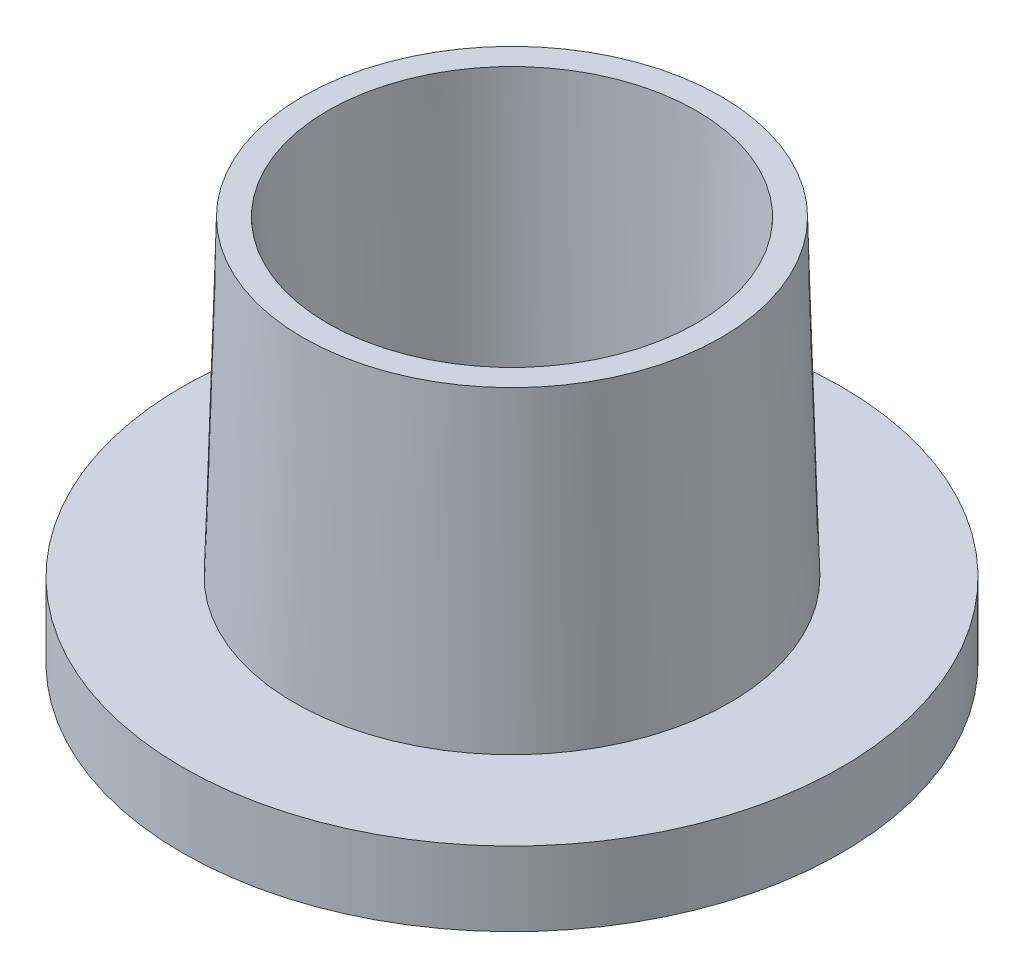
ISO-10303-21;
HEADER;
FILE_DESCRIPTION(('STEP AP214'),'2;1');
FILE_NAME('part.step','',(''),(''),'','','');
FILE_SCHEMA(('AUTOMOTIVE_DESIGN { 1 0 10303 214 1 1 1 1 }'));
ENDSEC;
DATA;
#1=APPLICATION_CONTEXT('core data for automotive mechanical design processes');
#2=APPLICATION_PROTOCOL_DEFINITION('international standard','automotive_design',2000,#1);
#3=PRODUCT_CONTEXT('',#1,'mechanical');
#4=PRODUCT('Part','Part','',(#3));
#5=PRODUCT_RELATED_PRODUCT_CATEGORY('part','',(#4));
#6=PRODUCT_DEFINITION_FORMATION('','',#4);
#7=PRODUCT_DEFINITION_CONTEXT('part definition',#1,'design');
#8=PRODUCT_DEFINITION('design','',#6,#7);
#9=PRODUCT_DEFINITION_SHAPE('','',#8);
#10=(LENGTH_UNIT() NAMED_UNIT(*) SI_UNIT(.MILLI.,.METRE.));
#11=(NAMED_UNIT(*) PLANE_ANGLE_UNIT() SI_UNIT($,.RADIAN.));
#12=(NAMED_UNIT(*) SI_UNIT($,.STERADIAN.) SOLID_ANGLE_UNIT());
#13=UNCERTAINTY_MEASURE_WITH_UNIT(LENGTH_MEASURE(1.E-05),#10,'distance_accuracy_value','');
#14=(GEOMETRIC_REPRESENTATION_CONTEXT(3) GLOBAL_UNCERTAINTY_ASSIGNED_CONTEXT((#13)) GLOBAL_UNIT_ASSIGNED_CONTEXT((#10,
#11,#12)) REPRESENTATION_CONTEXT('',''));
#15=CARTESIAN_POINT('',(0.,0.,0.));
#16=DIRECTION('',(0.,0.,1.));
#17=DIRECTION('',(1.,0.,0.));
#18=AXIS2_PLACEMENT_3D('',#15,#16,#17);
#19=CARTESIAN_POINT('',(-20.,0.,0.));
#20=DIRECTION('',(0.,1.,0.));
#21=DIRECTION('',(0.,0.,1.));
#22=AXIS2_PLACEMENT_3D('',#19,#20,#21);
#23=PLANE('',#22);
#24=CARTESIAN_POINT('',(0.,0.,0.));
#25=DIRECTION('',(0.,-1.,0.));
#26=DIRECTION('',(0.,0.,-1.));
#27=AXIS2_PLACEMENT_3D('',#24,#25,#26);
#28=CIRCLE('',#27,10.6);
#29=CARTESIAN_POINT('',(0.,0.,-10.6));
#30=VERTEX_POINT('',#29);
#31=EDGE_CURVE('E64',#30,#30,#28,.T.);
#32=ORIENTED_EDGE('',*,*,#31,.F.);
#33=EDGE_LOOP('',(#32));
#34=FACE_BOUND('',#33,.T.);
#35=CARTESIAN_POINT('',(0.,0.,0.));
#36=DIRECTION('',(0.,-1.,0.));
#37=DIRECTION('',(0.,0.,-1.));
#38=AXIS2_PLACEMENT_3D('',#35,#36,#37);
#39=CIRCLE('',#38,20.);
#40=CARTESIAN_POINT('',(0.,0.,-20.));
#41=VERTEX_POINT('',#40);
#42=EDGE_CURVE('E10',#41,#41,#39,.T.);
#43=ORIENTED_EDGE('',*,*,#42,.T.);
#44=EDGE_LOOP('',(#43));
#45=FACE_BOUND('',#44,.T.);
#46=ADVANCED_FACE('F37',(#34,#45),#23,.F.);
#47=CARTESIAN_POINT('',(0.,0.,0.));
#48=DIRECTION('',(0.,-1.,0.));
#49=DIRECTION('',(0.,0.,-1.));
#50=AXIS2_PLACEMENT_3D('',#47,#48,#49);
#51=CYLINDRICAL_SURFACE('',#50,20.);
#52=ORIENTED_EDGE('',*,*,#42,.F.);
#53=EDGE_LOOP('',(#52));
#54=FACE_BOUND('',#53,.T.);
#55=CARTESIAN_POINT('',(0.,4.5,0.));
#56=DIRECTION('',(0.,-1.,0.));
#57=DIRECTION('',(0.,0.,-1.));
#58=AXIS2_PLACEMENT_3D('',#55,#56,#57);
#59=CIRCLE('',#58,20.);
#60=CARTESIAN_POINT('',(0.,4.5,-20.));
#61=VERTEX_POINT('',#60);
#62=EDGE_CURVE('E44',#61,#61,#59,.T.);
#63=ORIENTED_EDGE('',*,*,#62,.T.);
#64=EDGE_LOOP('',(#63));
#65=FACE_BOUND('',#64,.T.);
#66=ADVANCED_FACE('F72',(#54,#65),#51,.T.);
#67=CARTESIAN_POINT('',(-13.2127158461161,4.5,0.));
#68=DIRECTION('',(0.,-1.,0.));
#69=DIRECTION('',(0.,0.,-1.));
#70=AXIS2_PLACEMENT_3D('',#67,#68,#69);
#71=PLANE('',#70);
#72=ORIENTED_EDGE('',*,*,#62,.F.);
#73=EDGE_LOOP('',(#72));
#74=FACE_BOUND('',#73,.T.);
#75=CARTESIAN_POINT('',(0.,4.5,0.));
#76=DIRECTION('',(0.,-1.,0.));
#77=DIRECTION('',(0.,0.,-1.));
#78=AXIS2_PLACEMENT_3D('',#75,#76,#77);
#79=CIRCLE('',#78,13.2127158461161);
#80=CARTESIAN_POINT('',(0.,4.5,-13.2127158461161));
#81=VERTEX_POINT('',#80);
#82=EDGE_CURVE('E49',#81,#81,#79,.T.);
#83=ORIENTED_EDGE('',*,*,#82,.T.);
#84=EDGE_LOOP('',(#83));
#85=FACE_BOUND('',#84,.T.);
#86=ADVANCED_FACE('F76',(#74,#85),#71,.F.);
#87=CARTESIAN_POINT('',(0.,23.42,0.));
#88=DIRECTION('',(0.,-1.,0.));
#89=DIRECTION('',(0.,0.,-1.));
#90=AXIS2_PLACEMENT_3D('',#87,#88,#89);
#91=CONICAL_SURFACE('',#90,12.685,0.0278847284594017);
#92=ORIENTED_EDGE('',*,*,#82,.F.);
#93=EDGE_LOOP('',(#92));
#94=FACE_BOUND('',#93,.T.);
#95=CARTESIAN_POINT('',(0.,23.42,0.));
#96=DIRECTION('',(0.,-1.,0.));
#97=DIRECTION('',(0.,0.,-1.));
#98=AXIS2_PLACEMENT_3D('',#95,#96,#97);
#99=CIRCLE('',#98,12.685);
#100=CARTESIAN_POINT('',(0.,23.42,-12.685));
#101=VERTEX_POINT('',#100);
#102=EDGE_CURVE('E54',#101,#101,#99,.T.);
#103=ORIENTED_EDGE('',*,*,#102,.T.);
#104=EDGE_LOOP('',(#103));
#105=FACE_BOUND('',#104,.T.);
#106=ADVANCED_FACE('F81',(#94,#105),#91,.T.);
#107=CARTESIAN_POINT('',(-11.185,23.42,0.));
#108=DIRECTION('',(0.,-1.,0.));
#109=DIRECTION('',(0.,0.,-1.));
#110=AXIS2_PLACEMENT_3D('',#107,#108,#109);
#111=PLANE('',#110);
#112=ORIENTED_EDGE('',*,*,#102,.F.);
#113=EDGE_LOOP('',(#112));
#114=FACE_BOUND('',#113,.T.);
#115=CARTESIAN_POINT('',(0.,23.42,0.));
#116=DIRECTION('',(0.,-1.,0.));
#117=DIRECTION('',(0.,0.,-1.));
#118=AXIS2_PLACEMENT_3D('',#115,#116,#117);
#119=CIRCLE('',#118,11.185);
#120=CARTESIAN_POINT('',(0.,23.42,-11.185));
#121=VERTEX_POINT('',#120);
#122=EDGE_CURVE('E60',#121,#121,#119,.T.);
#123=ORIENTED_EDGE('',*,*,#122,.T.);
#124=EDGE_LOOP('',(#123));
#125=FACE_BOUND('',#124,.T.);
#126=ADVANCED_FACE('F87',(#114,#125),#111,.F.);
#127=CARTESIAN_POINT('',(0.,0.,0.));
#128=DIRECTION('',(0.,1.,0.));
#129=DIRECTION('',(0.,0.,1.));
#130=AXIS2_PLACEMENT_3D('',#127,#128,#129);
#131=CONICAL_SURFACE('',#130,10.6,0.0249734576683801);
#132=ORIENTED_EDGE('',*,*,#122,.F.);
#133=EDGE_LOOP('',(#132));
#134=FACE_BOUND('',#133,.T.);
#135=ORIENTED_EDGE('',*,*,#31,.T.);
#136=EDGE_LOOP('',(#135));
#137=FACE_BOUND('',#136,.T.);
#138=ADVANCED_FACE('F69',(#134,#137),#131,.F.);
#139=CLOSED_SHELL('',(#46,#66,#86,#106,#126,#138));
#140=MANIFOLD_SOLID_BREP('B2',#139);
#141=ADVANCED_BREP_SHAPE_REPRESENTATION('',(#18,#140),#14);
#142=SHAPE_DEFINITION_REPRESENTATION(#9,#141);
ENDSEC;
END-ISO-10303-21;
